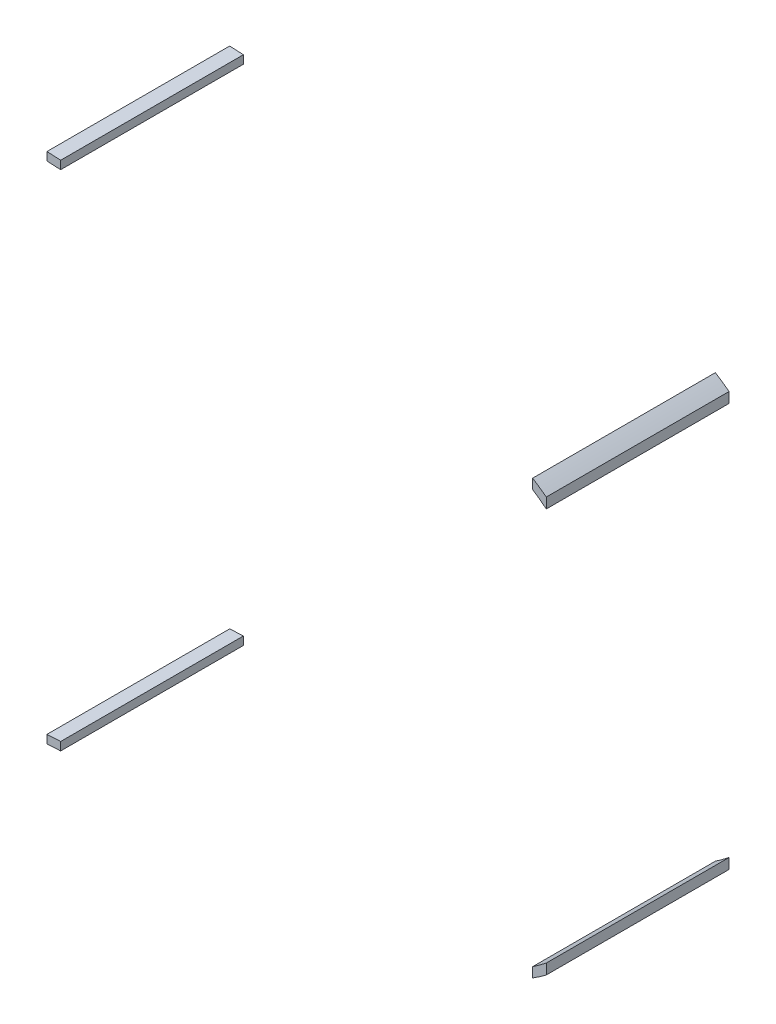
ISO-10303-21;
HEADER;
FILE_DESCRIPTION(('STEP AP214'),'2;1');
FILE_NAME('part.step','',(''),(''),'','','');
FILE_SCHEMA(('AUTOMOTIVE_DESIGN { 1 0 10303 214 1 1 1 1 }'));
ENDSEC;
DATA;
#1=APPLICATION_CONTEXT('core data for automotive mechanical design processes');
#2=APPLICATION_PROTOCOL_DEFINITION('international standard','automotive_design',2000,#1);
#3=PRODUCT_CONTEXT('',#1,'mechanical');
#4=PRODUCT('Part','Part','',(#3));
#5=PRODUCT_RELATED_PRODUCT_CATEGORY('part','',(#4));
#6=PRODUCT_DEFINITION_FORMATION('','',#4);
#7=PRODUCT_DEFINITION_CONTEXT('part definition',#1,'design');
#8=PRODUCT_DEFINITION('design','',#6,#7);
#9=PRODUCT_DEFINITION_SHAPE('','',#8);
#10=(LENGTH_UNIT() NAMED_UNIT(*) SI_UNIT(.MILLI.,.METRE.));
#11=(NAMED_UNIT(*) PLANE_ANGLE_UNIT() SI_UNIT($,.RADIAN.));
#12=(NAMED_UNIT(*) SI_UNIT($,.STERADIAN.) SOLID_ANGLE_UNIT());
#13=UNCERTAINTY_MEASURE_WITH_UNIT(LENGTH_MEASURE(1.E-05),#10,'distance_accuracy_value','');
#14=(GEOMETRIC_REPRESENTATION_CONTEXT(3) GLOBAL_UNCERTAINTY_ASSIGNED_CONTEXT((#13)) GLOBAL_UNIT_ASSIGNED_CONTEXT((#10,
#11,#12)) REPRESENTATION_CONTEXT('',''));
#15=CARTESIAN_POINT('',(0.,0.,0.));
#16=DIRECTION('',(0.,0.,1.));
#17=DIRECTION('',(1.,0.,0.));
#18=AXIS2_PLACEMENT_3D('',#15,#16,#17);
#19=CARTESIAN_POINT('',(19.8026066350711,49.7447573011769,40.));
#20=DIRECTION('',(-1.,0.,0.));
#21=DIRECTION('',(0.,0.,1.));
#22=AXIS2_PLACEMENT_3D('',#19,#20,#21);
#23=PLANE('',#22);
#24=DIRECTION('',(0.,1.,0.));
#25=VECTOR('',#24,1.);
#26=CARTESIAN_POINT('',(19.8026066350711,49.7447573011769,0.));
#27=LINE('',#26,#25);
#28=CARTESIAN_POINT('',(19.8026066350711,49.7447573011769,0.));
#29=VERTEX_POINT('',#28);
#30=CARTESIAN_POINT('',(19.8026066350711,51.5470550162142,0.));
#31=VERTEX_POINT('',#30);
#32=EDGE_CURVE('E113',#29,#31,#27,.T.);
#33=ORIENTED_EDGE('',*,*,#32,.T.);
#34=DIRECTION('',(0.,0.,-1.));
#35=VECTOR('',#34,1.);
#36=CARTESIAN_POINT('',(19.8026066350711,51.5470550162142,40.));
#37=LINE('',#36,#35);
#38=CARTESIAN_POINT('',(19.8026066350711,51.5470550162142,40.));
#39=VERTEX_POINT('',#38);
#40=EDGE_CURVE('E12',#39,#31,#37,.T.);
#41=ORIENTED_EDGE('',*,*,#40,.F.);
#42=DIRECTION('',(0.,1.,0.));
#43=VECTOR('',#42,1.);
#44=CARTESIAN_POINT('',(19.8026066350711,49.7447573011769,40.));
#45=LINE('',#44,#43);
#46=CARTESIAN_POINT('',(19.8026066350711,49.7447573011769,40.));
#47=VERTEX_POINT('',#46);
#48=EDGE_CURVE('E101',#47,#39,#45,.T.);
#49=ORIENTED_EDGE('',*,*,#48,.F.);
#50=DIRECTION('',(0.,0.,-1.));
#51=VECTOR('',#50,1.);
#52=CARTESIAN_POINT('',(19.8026066350711,49.7447573011769,40.));
#53=LINE('',#52,#51);
#54=EDGE_CURVE('E109',#47,#29,#53,.T.);
#55=ORIENTED_EDGE('',*,*,#54,.T.);
#56=EDGE_LOOP('',(#33,#41,#49,#55));
#57=FACE_BOUND('',#56,.T.);
#58=ADVANCED_FACE('F50',(#57),#23,.F.);
#59=CARTESIAN_POINT('',(16.8026066350711,51.6986855396437,40.));
#60=DIRECTION('',(-0.0504790708541755,-0.998725119042121,0.));
#61=DIRECTION('',(0.998725119042121,-0.0504790708541755,0.));
#62=AXIS2_PLACEMENT_3D('',#59,#60,#61);
#63=PLANE('',#62);
#64=DIRECTION('',(-0.998725119042121,0.0504790708541755,0.));
#65=VECTOR('',#64,1.);
#66=CARTESIAN_POINT('',(16.8026066350711,51.6986855396437,0.));
#67=LINE('',#66,#65);
#68=CARTESIAN_POINT('',(16.8026066350711,51.6986855396437,0.));
#69=VERTEX_POINT('',#68);
#70=EDGE_CURVE('E105',#31,#69,#67,.T.);
#71=ORIENTED_EDGE('',*,*,#70,.T.);
#72=DIRECTION('',(0.,0.,-1.));
#73=VECTOR('',#72,1.);
#74=CARTESIAN_POINT('',(16.8026066350711,51.6986855396437,40.));
#75=LINE('',#74,#73);
#76=CARTESIAN_POINT('',(16.8026066350711,51.6986855396437,40.));
#77=VERTEX_POINT('',#76);
#78=EDGE_CURVE('E58',#77,#69,#75,.T.);
#79=ORIENTED_EDGE('',*,*,#78,.F.);
#80=DIRECTION('',(-0.998725119042121,0.0504790708541755,0.));
#81=VECTOR('',#80,1.);
#82=CARTESIAN_POINT('',(16.8026066350711,51.6986855396437,40.));
#83=LINE('',#82,#81);
#84=EDGE_CURVE('E96',#39,#77,#83,.T.);
#85=ORIENTED_EDGE('',*,*,#84,.F.);
#86=ORIENTED_EDGE('',*,*,#40,.T.);
#87=EDGE_LOOP('',(#71,#79,#85,#86));
#88=FACE_BOUND('',#87,.T.);
#89=ADVANCED_FACE('F104',(#88),#63,.F.);
#90=CARTESIAN_POINT('',(16.8026066350711,49.8963878246064,40.));
#91=DIRECTION('',(1.,0.,0.));
#92=DIRECTION('',(0.,1.,0.));
#93=AXIS2_PLACEMENT_3D('',#90,#91,#92);
#94=PLANE('',#93);
#95=DIRECTION('',(0.,-1.,0.));
#96=VECTOR('',#95,1.);
#97=CARTESIAN_POINT('',(16.8026066350711,49.8963878246064,0.));
#98=LINE('',#97,#96);
#99=CARTESIAN_POINT('',(16.8026066350711,49.8963878246064,0.));
#100=VERTEX_POINT('',#99);
#101=EDGE_CURVE('E83',#69,#100,#98,.T.);
#102=ORIENTED_EDGE('',*,*,#101,.T.);
#103=DIRECTION('',(0.,0.,-1.));
#104=VECTOR('',#103,1.);
#105=CARTESIAN_POINT('',(16.8026066350711,49.8963878246064,40.));
#106=LINE('',#105,#104);
#107=CARTESIAN_POINT('',(16.8026066350711,49.8963878246064,40.));
#108=VERTEX_POINT('',#107);
#109=EDGE_CURVE('E106',#108,#100,#106,.T.);
#110=ORIENTED_EDGE('',*,*,#109,.F.);
#111=DIRECTION('',(0.,-1.,0.));
#112=VECTOR('',#111,1.);
#113=CARTESIAN_POINT('',(16.8026066350711,49.8963878246064,40.));
#114=LINE('',#113,#112);
#115=EDGE_CURVE('E99',#77,#108,#114,.T.);
#116=ORIENTED_EDGE('',*,*,#115,.F.);
#117=ORIENTED_EDGE('',*,*,#78,.T.);
#118=EDGE_LOOP('',(#102,#110,#116,#117));
#119=FACE_BOUND('',#118,.T.);
#120=ADVANCED_FACE('F107',(#119),#94,.F.);
#121=CARTESIAN_POINT('',(19.8026066350711,49.7447573011769,40.));
#122=DIRECTION('',(0.0504790708541733,0.998725119042121,0.));
#123=DIRECTION('',(-0.998725119042121,0.0504790708541733,0.));
#124=AXIS2_PLACEMENT_3D('',#121,#122,#123);
#125=PLANE('',#124);
#126=DIRECTION('',(0.998725119042121,-0.0504790708541733,0.));
#127=VECTOR('',#126,1.);
#128=CARTESIAN_POINT('',(19.8026066350711,49.7447573011769,0.));
#129=LINE('',#128,#127);
#130=EDGE_CURVE('E89',#100,#29,#129,.T.);
#131=ORIENTED_EDGE('',*,*,#130,.T.);
#132=ORIENTED_EDGE('',*,*,#54,.F.);
#133=DIRECTION('',(0.998725119042121,-0.0504790708541733,0.));
#134=VECTOR('',#133,1.);
#135=CARTESIAN_POINT('',(19.8026066350711,49.7447573011769,40.));
#136=LINE('',#135,#134);
#137=EDGE_CURVE('E66',#108,#47,#136,.T.);
#138=ORIENTED_EDGE('',*,*,#137,.F.);
#139=ORIENTED_EDGE('',*,*,#109,.T.);
#140=EDGE_LOOP('',(#131,#132,#138,#139));
#141=FACE_BOUND('',#140,.T.);
#142=ADVANCED_FACE('F120',(#141),#125,.F.);
#143=CARTESIAN_POINT('',(0.,0.,40.));
#144=DIRECTION('',(0.,0.,-1.));
#145=DIRECTION('',(-1.,0.,0.));
#146=AXIS2_PLACEMENT_3D('',#143,#144,#145);
#147=PLANE('',#146);
#148=ORIENTED_EDGE('',*,*,#48,.T.);
#149=ORIENTED_EDGE('',*,*,#84,.T.);
#150=ORIENTED_EDGE('',*,*,#115,.T.);
#151=ORIENTED_EDGE('',*,*,#137,.T.);
#152=EDGE_LOOP('',(#148,#149,#150,#151));
#153=FACE_BOUND('',#152,.T.);
#154=ADVANCED_FACE('F97',(#153),#147,.F.);
#155=CARTESIAN_POINT('',(0.,0.,0.));
#156=DIRECTION('',(0.,0.,-1.));
#157=DIRECTION('',(-1.,0.,0.));
#158=AXIS2_PLACEMENT_3D('',#155,#156,#157);
#159=PLANE('',#158);
#160=ORIENTED_EDGE('',*,*,#32,.F.);
#161=ORIENTED_EDGE('',*,*,#130,.F.);
#162=ORIENTED_EDGE('',*,*,#101,.F.);
#163=ORIENTED_EDGE('',*,*,#70,.F.);
#164=EDGE_LOOP('',(#160,#161,#162,#163));
#165=FACE_BOUND('',#164,.T.);
#166=ADVANCED_FACE('F123',(#165),#159,.T.);
#167=CLOSED_SHELL('',(#58,#89,#120,#142,#154,#166));
#168=MANIFOLD_SOLID_BREP('B2',#167);
#169=CARTESIAN_POINT('',(123.102606631487,40.7834426184924,40.));
#170=CARTESIAN_POINT('',(124.131030901251,40.09355676601,40.));
#171=CARTESIAN_POINT('',(125.126920542178,39.3562338158426,40.));
#172=CARTESIAN_POINT('',(126.10260663293,38.5894530904536,40.));
#173=B_SPLINE_CURVE_WITH_KNOTS('',3,(#169,#170,#171,#172),.UNSPECIFIED.,.F.,.F.,(4,4),(0.,
0.241038019452371),.UNSPECIFIED.);
#174=DIRECTION('',(0.,0.,-1.));
#175=VECTOR('',#174,1.);
#176=SURFACE_OF_LINEAR_EXTRUSION('',#173,#175);
#177=CARTESIAN_POINT('',(123.102606631487,40.7834426184924,0.));
#178=CARTESIAN_POINT('',(124.131030901251,40.09355676601,0.));
#179=CARTESIAN_POINT('',(125.126920542178,39.3562338158426,0.));
#180=CARTESIAN_POINT('',(126.10260663293,38.5894530904536,0.));
#181=B_SPLINE_CURVE_WITH_KNOTS('',3,(#177,#178,#179,#180),.UNSPECIFIED.,.F.,.F.,(4,4),(0.,
0.241038019452371),.UNSPECIFIED.);
#182=CARTESIAN_POINT('',(123.102606631487,40.7834426184924,0.));
#183=VERTEX_POINT('',#182);
#184=CARTESIAN_POINT('',(126.10260663293,38.5894530904536,0.));
#185=VERTEX_POINT('',#184);
#186=EDGE_CURVE('E342',#183,#185,#181,.T.);
#187=ORIENTED_EDGE('',*,*,#186,.T.);
#188=DIRECTION('',(0.,0.,-1.));
#189=VECTOR('',#188,1.);
#190=CARTESIAN_POINT('',(126.10260663293,38.5894530904536,40.));
#191=LINE('',#190,#189);
#192=CARTESIAN_POINT('',(126.10260663293,38.5894530904536,40.));
#193=VERTEX_POINT('',#192);
#194=EDGE_CURVE('E48',#193,#185,#191,.T.);
#195=ORIENTED_EDGE('',*,*,#194,.F.);
#196=CARTESIAN_POINT('',(126.10260663293,38.5894530904536,40.));
#197=CARTESIAN_POINT('',(125.126920542178,39.3562338158426,40.));
#198=CARTESIAN_POINT('',(124.131030901251,40.09355676601,40.));
#199=CARTESIAN_POINT('',(123.102606631487,40.7834426184924,40.));
#200=B_SPLINE_CURVE_WITH_KNOTS('',3,(#196,#197,#198,#199),.UNSPECIFIED.,.F.,.F.,(4,4),(0.,
0.241038019452371),.UNSPECIFIED.);
#201=CARTESIAN_POINT('',(123.102606631487,40.7834426184924,40.));
#202=VERTEX_POINT('',#201);
#203=EDGE_CURVE('E243',#202,#193,#200,.F.);
#204=ORIENTED_EDGE('',*,*,#203,.F.);
#205=DIRECTION('',(0.,0.,-1.));
#206=VECTOR('',#205,1.);
#207=CARTESIAN_POINT('',(123.102606631487,40.7834426184924,40.));
#208=LINE('',#207,#206);
#209=EDGE_CURVE('E328',#202,#183,#208,.T.);
#210=ORIENTED_EDGE('',*,*,#209,.T.);
#211=EDGE_LOOP('',(#187,#195,#204,#210));
#212=FACE_BOUND('',#211,.T.);
#213=ADVANCED_FACE('F184',(#212),#176,.F.);
#214=CARTESIAN_POINT('',(126.102606631489,40.8584151195204,40.));
#215=DIRECTION('',(-1.,-6.35367440709757E-10,0.));
#216=DIRECTION('',(6.35367440709757E-10,-1.,0.));
#217=AXIS2_PLACEMENT_3D('',#214,#215,#216);
#218=PLANE('',#217);
#219=DIRECTION('',(-6.35367440709757E-10,1.,0.));
#220=VECTOR('',#219,1.);
#221=CARTESIAN_POINT('',(126.102606631489,40.8584151195204,0.));
#222=LINE('',#221,#220);
#223=CARTESIAN_POINT('',(126.102606631489,40.8584151195204,0.));
#224=VERTEX_POINT('',#223);
#225=EDGE_CURVE('E248',#185,#224,#222,.T.);
#226=ORIENTED_EDGE('',*,*,#225,.T.);
#227=DIRECTION('',(0.,0.,-1.));
#228=VECTOR('',#227,1.);
#229=CARTESIAN_POINT('',(126.102606631489,40.8584151195204,40.));
#230=LINE('',#229,#228);
#231=CARTESIAN_POINT('',(126.102606631489,40.8584151195204,40.));
#232=VERTEX_POINT('',#231);
#233=EDGE_CURVE('E197',#232,#224,#230,.T.);
#234=ORIENTED_EDGE('',*,*,#233,.F.);
#235=DIRECTION('',(-6.35367440709757E-10,1.,0.));
#236=VECTOR('',#235,1.);
#237=CARTESIAN_POINT('',(126.102606631489,40.8584151195204,40.));
#238=LINE('',#237,#236);
#239=EDGE_CURVE('E237',#193,#232,#238,.T.);
#240=ORIENTED_EDGE('',*,*,#239,.F.);
#241=ORIENTED_EDGE('',*,*,#194,.T.);
#242=EDGE_LOOP('',(#226,#234,#240,#241));
#243=FACE_BOUND('',#242,.T.);
#244=ADVANCED_FACE('F247',(#243),#218,.F.);
#245=CARTESIAN_POINT('',(126.102606631489,40.8584151195204,40.));
#246=CARTESIAN_POINT('',(125.127954037551,41.5879931882622,40.));
#247=CARTESIAN_POINT('',(124.131312478951,42.2834784096465,40.));
#248=CARTESIAN_POINT('',(123.102606631487,42.9292494710995,40.));
#249=B_SPLINE_CURVE_WITH_KNOTS('',3,(#245,#246,#247,#248),.UNSPECIFIED.,.F.,.F.,(4,4),
(0.757538637454445,1.),.UNSPECIFIED.);
#250=DIRECTION('',(0.,0.,-1.));
#251=VECTOR('',#250,1.);
#252=SURFACE_OF_LINEAR_EXTRUSION('',#249,#251);
#253=CARTESIAN_POINT('',(126.102606631489,40.8584151195204,0.));
#254=CARTESIAN_POINT('',(125.127954037551,41.5879931882622,0.));
#255=CARTESIAN_POINT('',(124.131312478951,42.2834784096465,0.));
#256=CARTESIAN_POINT('',(123.102606631487,42.9292494710995,0.));
#257=B_SPLINE_CURVE_WITH_KNOTS('',3,(#253,#254,#255,#256),.UNSPECIFIED.,.F.,.F.,(4,4),
(0.757538637454445,1.),.UNSPECIFIED.);
#258=CARTESIAN_POINT('',(123.102606631488,42.9292494710995,0.));
#259=VERTEX_POINT('',#258);
#260=EDGE_CURVE('E223',#224,#259,#257,.T.);
#261=ORIENTED_EDGE('',*,*,#260,.T.);
#262=DIRECTION('',(0.,0.,-1.));
#263=VECTOR('',#262,1.);
#264=CARTESIAN_POINT('',(123.102606631488,42.9292494710995,40.));
#265=LINE('',#264,#263);
#266=CARTESIAN_POINT('',(123.102606631488,42.9292494710995,40.));
#267=VERTEX_POINT('',#266);
#268=EDGE_CURVE('E249',#267,#259,#265,.T.);
#269=ORIENTED_EDGE('',*,*,#268,.F.);
#270=CARTESIAN_POINT('',(123.102606631487,42.9292494710995,40.));
#271=CARTESIAN_POINT('',(124.131312478951,42.2834784096465,40.));
#272=CARTESIAN_POINT('',(125.127954037551,41.5879931882622,40.));
#273=CARTESIAN_POINT('',(126.102606631489,40.8584151195204,40.));
#274=B_SPLINE_CURVE_WITH_KNOTS('',3,(#270,#271,#272,#273),.UNSPECIFIED.,.F.,.F.,(4,4),
(0.757538637454445,1.),.UNSPECIFIED.);
#275=EDGE_CURVE('E240',#232,#267,#274,.F.);
#276=ORIENTED_EDGE('',*,*,#275,.F.);
#277=ORIENTED_EDGE('',*,*,#233,.T.);
#278=EDGE_LOOP('',(#261,#269,#276,#277));
#279=FACE_BOUND('',#278,.T.);
#280=ADVANCED_FACE('F252',(#279),#252,.F.);
#281=CARTESIAN_POINT('',(123.102606631487,40.7834426184924,40.));
#282=DIRECTION('',(1.,0.,0.));
#283=DIRECTION('',(0.,1.,0.));
#284=AXIS2_PLACEMENT_3D('',#281,#282,#283);
#285=PLANE('',#284);
#286=DIRECTION('',(0.,-1.,0.));
#287=VECTOR('',#286,1.);
#288=CARTESIAN_POINT('',(123.102606631487,40.7834426184924,0.));
#289=LINE('',#288,#287);
#290=EDGE_CURVE('E230',#259,#183,#289,.T.);
#291=ORIENTED_EDGE('',*,*,#290,.T.);
#292=ORIENTED_EDGE('',*,*,#209,.F.);
#293=DIRECTION('',(0.,-1.,0.));
#294=VECTOR('',#293,1.);
#295=CARTESIAN_POINT('',(123.102606631487,40.7834426184924,40.));
#296=LINE('',#295,#294);
#297=EDGE_CURVE('E206',#267,#202,#296,.T.);
#298=ORIENTED_EDGE('',*,*,#297,.F.);
#299=ORIENTED_EDGE('',*,*,#268,.T.);
#300=EDGE_LOOP('',(#291,#292,#298,#299));
#301=FACE_BOUND('',#300,.T.);
#302=ADVANCED_FACE('F271',(#301),#285,.F.);
#303=CARTESIAN_POINT('',(124.622383449338,39.715283431813,40.));
#304=DIRECTION('',(0.,0.,-1.));
#305=DIRECTION('',(-1.,0.,0.));
#306=AXIS2_PLACEMENT_3D('',#303,#304,#305);
#307=PLANE('',#306);
#308=ORIENTED_EDGE('',*,*,#203,.T.);
#309=ORIENTED_EDGE('',*,*,#239,.T.);
#310=ORIENTED_EDGE('',*,*,#275,.T.);
#311=ORIENTED_EDGE('',*,*,#297,.T.);
#312=EDGE_LOOP('',(#308,#309,#310,#311));
#313=FACE_BOUND('',#312,.T.);
#314=ADVANCED_FACE('F238',(#313),#307,.F.);
#315=CARTESIAN_POINT('',(124.622383449338,39.715283431813,0.));
#316=DIRECTION('',(0.,0.,-1.));
#317=DIRECTION('',(-1.,0.,0.));
#318=AXIS2_PLACEMENT_3D('',#315,#316,#317);
#319=PLANE('',#318);
#320=ORIENTED_EDGE('',*,*,#186,.F.);
#321=ORIENTED_EDGE('',*,*,#290,.F.);
#322=ORIENTED_EDGE('',*,*,#260,.F.);
#323=ORIENTED_EDGE('',*,*,#225,.F.);
#324=EDGE_LOOP('',(#320,#321,#322,#323));
#325=FACE_BOUND('',#324,.T.);
#326=ADVANCED_FACE('F301',(#325),#319,.T.);
#327=CLOSED_SHELL('',(#213,#244,#280,#302,#314,#326));
#328=MANIFOLD_SOLID_BREP('B6',#327);
#329=CARTESIAN_POINT('',(126.102606631487,-47.475709012651,40.));
#330=CARTESIAN_POINT('',(125.126920541239,-48.2424897386817,40.));
#331=CARTESIAN_POINT('',(124.131030900797,-48.9798126895041,40.));
#332=CARTESIAN_POINT('',(123.102606631487,-49.669698542663,40.));
#333=B_SPLINE_CURVE_WITH_KNOTS('',3,(#329,#330,#331,#332),.UNSPECIFIED.,.F.,.F.,(4,4),(0.,
0.241038019452371),.UNSPECIFIED.);
#334=DIRECTION('',(0.,0.,-1.));
#335=VECTOR('',#334,1.);
#336=SURFACE_OF_LINEAR_EXTRUSION('',#333,#335);
#337=CARTESIAN_POINT('',(126.102606631487,-47.475709012651,0.));
#338=CARTESIAN_POINT('',(125.126920541239,-48.2424897386817,0.));
#339=CARTESIAN_POINT('',(124.131030900797,-48.9798126895041,0.));
#340=CARTESIAN_POINT('',(123.102606631487,-49.669698542663,0.));
#341=B_SPLINE_CURVE_WITH_KNOTS('',3,(#337,#338,#339,#340),.UNSPECIFIED.,.F.,.F.,(4,4),(0.,
0.241038019452371),.UNSPECIFIED.);
#342=CARTESIAN_POINT('',(126.102606631487,-47.475709012651,0.));
#343=VERTEX_POINT('',#342);
#344=CARTESIAN_POINT('',(123.102606631487,-49.669698542663,0.));
#345=VERTEX_POINT('',#344);
#346=EDGE_CURVE('E586',#343,#345,#341,.T.);
#347=ORIENTED_EDGE('',*,*,#346,.T.);
#348=DIRECTION('',(0.,0.,-1.));
#349=VECTOR('',#348,1.);
#350=CARTESIAN_POINT('',(123.102606631487,-49.669698542663,40.));
#351=LINE('',#350,#349);
#352=CARTESIAN_POINT('',(123.102606631487,-49.669698542663,40.));
#353=VERTEX_POINT('',#352);
#354=EDGE_CURVE('E182',#353,#345,#351,.T.);
#355=ORIENTED_EDGE('',*,*,#354,.F.);
#356=CARTESIAN_POINT('',(123.102606631487,-49.669698542663,40.));
#357=CARTESIAN_POINT('',(124.131030900797,-48.9798126895041,40.));
#358=CARTESIAN_POINT('',(125.126920541239,-48.2424897386817,40.));
#359=CARTESIAN_POINT('',(126.102606631487,-47.475709012651,40.));
#360=B_SPLINE_CURVE_WITH_KNOTS('',3,(#356,#357,#358,#359),.UNSPECIFIED.,.F.,.F.,(4,4),(0.,
0.241038019452371),.UNSPECIFIED.);
#361=CARTESIAN_POINT('',(126.102606631487,-47.475709012651,40.));
#362=VERTEX_POINT('',#361);
#363=EDGE_CURVE('E483',#362,#353,#360,.F.);
#364=ORIENTED_EDGE('',*,*,#363,.F.);
#365=DIRECTION('',(0.,0.,-1.));
#366=VECTOR('',#365,1.);
#367=CARTESIAN_POINT('',(126.102606631487,-47.475709012651,40.));
#368=LINE('',#367,#366);
#369=EDGE_CURVE('E571',#362,#343,#368,.T.);
#370=ORIENTED_EDGE('',*,*,#369,.T.);
#371=EDGE_LOOP('',(#347,#355,#364,#370));
#372=FACE_BOUND('',#371,.T.);
#373=ADVANCED_FACE('F423',(#372),#336,.F.);
#374=CARTESIAN_POINT('',(123.102606631487,-49.669698542663,40.));
#375=DIRECTION('',(1.,0.,0.));
#376=DIRECTION('',(0.,1.,0.));
#377=AXIS2_PLACEMENT_3D('',#374,#375,#376);
#378=PLANE('',#377);
#379=DIRECTION('',(0.,-1.,0.));
#380=VECTOR('',#379,1.);
#381=CARTESIAN_POINT('',(123.102606631487,-49.669698542663,0.));
#382=LINE('',#381,#380);
#383=CARTESIAN_POINT('',(123.102606631487,-51.8155053952701,0.));
#384=VERTEX_POINT('',#383);
#385=EDGE_CURVE('E489',#345,#384,#382,.T.);
#386=ORIENTED_EDGE('',*,*,#385,.T.);
#387=DIRECTION('',(0.,0.,-1.));
#388=VECTOR('',#387,1.);
#389=CARTESIAN_POINT('',(123.102606631487,-51.8155053952701,40.));
#390=LINE('',#389,#388);
#391=CARTESIAN_POINT('',(123.102606631487,-51.8155053952701,40.));
#392=VERTEX_POINT('',#391);
#393=EDGE_CURVE('E437',#392,#384,#390,.T.);
#394=ORIENTED_EDGE('',*,*,#393,.F.);
#395=DIRECTION('',(0.,-1.,0.));
#396=VECTOR('',#395,1.);
#397=CARTESIAN_POINT('',(123.102606631487,-49.669698542663,40.));
#398=LINE('',#397,#396);
#399=EDGE_CURVE('E477',#353,#392,#398,.T.);
#400=ORIENTED_EDGE('',*,*,#399,.F.);
#401=ORIENTED_EDGE('',*,*,#354,.T.);
#402=EDGE_LOOP('',(#386,#394,#400,#401));
#403=FACE_BOUND('',#402,.T.);
#404=ADVANCED_FACE('F488',(#403),#378,.F.);
#405=CARTESIAN_POINT('',(123.102606631487,-51.8155053952701,40.));
#406=CARTESIAN_POINT('',(124.131312478951,-51.1697343338164,40.));
#407=CARTESIAN_POINT('',(125.12795403755,-50.4742491124314,40.));
#408=CARTESIAN_POINT('',(126.102606631487,-49.7446710436889,40.));
#409=B_SPLINE_CURVE_WITH_KNOTS('',3,(#405,#406,#407,#408),.UNSPECIFIED.,.F.,.F.,(4,4),
(0.757538637454445,1.),.UNSPECIFIED.);
#410=DIRECTION('',(0.,0.,-1.));
#411=VECTOR('',#410,1.);
#412=SURFACE_OF_LINEAR_EXTRUSION('',#409,#411);
#413=CARTESIAN_POINT('',(123.102606631487,-51.8155053952701,0.));
#414=CARTESIAN_POINT('',(124.131312478951,-51.1697343338164,0.));
#415=CARTESIAN_POINT('',(125.12795403755,-50.4742491124314,0.));
#416=CARTESIAN_POINT('',(126.102606631487,-49.7446710436889,0.));
#417=B_SPLINE_CURVE_WITH_KNOTS('',3,(#413,#414,#415,#416),.UNSPECIFIED.,.F.,.F.,(4,4),
(0.757538637454445,1.),.UNSPECIFIED.);
#418=CARTESIAN_POINT('',(126.102606631487,-49.7446710436889,0.));
#419=VERTEX_POINT('',#418);
#420=EDGE_CURVE('E463',#384,#419,#417,.T.);
#421=ORIENTED_EDGE('',*,*,#420,.T.);
#422=DIRECTION('',(0.,0.,-1.));
#423=VECTOR('',#422,1.);
#424=CARTESIAN_POINT('',(126.102606631487,-49.7446710436889,40.));
#425=LINE('',#424,#423);
#426=CARTESIAN_POINT('',(126.102606631487,-49.7446710436889,40.));
#427=VERTEX_POINT('',#426);
#428=EDGE_CURVE('E491',#427,#419,#425,.T.);
#429=ORIENTED_EDGE('',*,*,#428,.F.);
#430=CARTESIAN_POINT('',(126.102606631487,-49.7446710436889,40.));
#431=CARTESIAN_POINT('',(125.12795403755,-50.4742491124314,40.));
#432=CARTESIAN_POINT('',(124.131312478951,-51.1697343338164,40.));
#433=CARTESIAN_POINT('',(123.102606631487,-51.8155053952701,40.));
#434=B_SPLINE_CURVE_WITH_KNOTS('',3,(#430,#431,#432,#433),.UNSPECIFIED.,.F.,.F.,(4,4),
(0.757538637454445,1.),.UNSPECIFIED.);
#435=EDGE_CURVE('E480',#392,#427,#434,.F.);
#436=ORIENTED_EDGE('',*,*,#435,.F.);
#437=ORIENTED_EDGE('',*,*,#393,.T.);
#438=EDGE_LOOP('',(#421,#429,#436,#437));
#439=FACE_BOUND('',#438,.T.);
#440=ADVANCED_FACE('F494',(#439),#412,.F.);
#441=CARTESIAN_POINT('',(126.102606631487,-49.7446710436889,40.));
#442=DIRECTION('',(-1.,0.,0.));
#443=DIRECTION('',(0.,0.,1.));
#444=AXIS2_PLACEMENT_3D('',#441,#442,#443);
#445=PLANE('',#444);
#446=DIRECTION('',(0.,1.,0.));
#447=VECTOR('',#446,1.);
#448=CARTESIAN_POINT('',(126.102606631487,-49.7446710436889,0.));
#449=LINE('',#448,#447);
#450=EDGE_CURVE('E470',#419,#343,#449,.T.);
#451=ORIENTED_EDGE('',*,*,#450,.T.);
#452=ORIENTED_EDGE('',*,*,#369,.F.);
#453=DIRECTION('',(0.,1.,0.));
#454=VECTOR('',#453,1.);
#455=CARTESIAN_POINT('',(126.102606631487,-49.7446710436889,40.));
#456=LINE('',#455,#454);
#457=EDGE_CURVE('E446',#427,#362,#456,.T.);
#458=ORIENTED_EDGE('',*,*,#457,.F.);
#459=ORIENTED_EDGE('',*,*,#428,.T.);
#460=EDGE_LOOP('',(#451,#452,#458,#459));
#461=FACE_BOUND('',#460,.T.);
#462=ADVANCED_FACE('F514',(#461),#445,.F.);
#463=CARTESIAN_POINT('',(124.622383448636,-48.6015393549839,40.));
#464=DIRECTION('',(0.,0.,1.));
#465=DIRECTION('',(1.,0.,0.));
#466=AXIS2_PLACEMENT_3D('',#463,#464,#465);
#467=PLANE('',#466);
#468=ORIENTED_EDGE('',*,*,#363,.T.);
#469=ORIENTED_EDGE('',*,*,#399,.T.);
#470=ORIENTED_EDGE('',*,*,#435,.T.);
#471=ORIENTED_EDGE('',*,*,#457,.T.);
#472=EDGE_LOOP('',(#468,#469,#470,#471));
#473=FACE_BOUND('',#472,.T.);
#474=ADVANCED_FACE('F478',(#473),#467,.T.);
#475=CARTESIAN_POINT('',(124.622383448636,-48.6015393549839,0.));
#476=DIRECTION('',(0.,0.,1.));
#477=DIRECTION('',(1.,0.,0.));
#478=AXIS2_PLACEMENT_3D('',#475,#476,#477);
#479=PLANE('',#478);
#480=ORIENTED_EDGE('',*,*,#346,.F.);
#481=ORIENTED_EDGE('',*,*,#450,.F.);
#482=ORIENTED_EDGE('',*,*,#420,.F.);
#483=ORIENTED_EDGE('',*,*,#385,.F.);
#484=EDGE_LOOP('',(#480,#481,#482,#483));
#485=FACE_BOUND('',#484,.T.);
#486=ADVANCED_FACE('F544',(#485),#479,.F.);
#487=CLOSED_SHELL('',(#373,#404,#440,#462,#474,#486));
#488=MANIFOLD_SOLID_BREP('B42',#487);
#489=CARTESIAN_POINT('',(19.8026066350711,-58.6310132253474,40.));
#490=DIRECTION('',(0.0504790708541733,-0.998725119042121,0.));
#491=DIRECTION('',(0.998725119042121,0.0504790708541733,0.));
#492=AXIS2_PLACEMENT_3D('',#489,#490,#491);
#493=PLANE('',#492);
#494=DIRECTION('',(-0.998725119042121,-0.0504790708541733,0.));
#495=VECTOR('',#494,1.);
#496=CARTESIAN_POINT('',(19.8026066350711,-58.6310132253474,0.));
#497=LINE('',#496,#495);
#498=CARTESIAN_POINT('',(19.8026066350711,-58.6310132253474,0.));
#499=VERTEX_POINT('',#498);
#500=CARTESIAN_POINT('',(16.8026066350711,-58.7826437487768,0.));
#501=VERTEX_POINT('',#500);
#502=EDGE_CURVE('E728',#499,#501,#497,.T.);
#503=ORIENTED_EDGE('',*,*,#502,.T.);
#504=DIRECTION('',(0.,0.,-1.));
#505=VECTOR('',#504,1.);
#506=CARTESIAN_POINT('',(16.8026066350711,-58.7826437487768,40.));
#507=LINE('',#506,#505);
#508=CARTESIAN_POINT('',(16.8026066350711,-58.7826437487768,40.));
#509=VERTEX_POINT('',#508);
#510=EDGE_CURVE('E421',#509,#501,#507,.T.);
#511=ORIENTED_EDGE('',*,*,#510,.F.);
#512=DIRECTION('',(-0.998725119042121,-0.0504790708541733,0.));
#513=VECTOR('',#512,1.);
#514=CARTESIAN_POINT('',(19.8026066350711,-58.6310132253474,40.));
#515=LINE('',#514,#513);
#516=CARTESIAN_POINT('',(19.8026066350711,-58.6310132253474,40.));
#517=VERTEX_POINT('',#516);
#518=EDGE_CURVE('E716',#517,#509,#515,.T.);
#519=ORIENTED_EDGE('',*,*,#518,.F.);
#520=DIRECTION('',(0.,0.,-1.));
#521=VECTOR('',#520,1.);
#522=CARTESIAN_POINT('',(19.8026066350711,-58.6310132253474,40.));
#523=LINE('',#522,#521);
#524=EDGE_CURVE('E724',#517,#499,#523,.T.);
#525=ORIENTED_EDGE('',*,*,#524,.T.);
#526=EDGE_LOOP('',(#503,#511,#519,#525));
#527=FACE_BOUND('',#526,.T.);
#528=ADVANCED_FACE('F665',(#527),#493,.F.);
#529=CARTESIAN_POINT('',(16.8026066350711,-58.7826437487768,40.));
#530=DIRECTION('',(1.,0.,0.));
#531=DIRECTION('',(0.,1.,0.));
#532=AXIS2_PLACEMENT_3D('',#529,#530,#531);
#533=PLANE('',#532);
#534=DIRECTION('',(0.,-1.,0.));
#535=VECTOR('',#534,1.);
#536=CARTESIAN_POINT('',(16.8026066350711,-58.7826437487768,0.));
#537=LINE('',#536,#535);
#538=CARTESIAN_POINT('',(16.8026066350711,-60.5849414638142,0.));
#539=VERTEX_POINT('',#538);
#540=EDGE_CURVE('E720',#501,#539,#537,.T.);
#541=ORIENTED_EDGE('',*,*,#540,.T.);
#542=DIRECTION('',(0.,0.,-1.));
#543=VECTOR('',#542,1.);
#544=CARTESIAN_POINT('',(16.8026066350711,-60.5849414638142,40.));
#545=LINE('',#544,#543);
#546=CARTESIAN_POINT('',(16.8026066350711,-60.5849414638142,40.));
#547=VERTEX_POINT('',#546);
#548=EDGE_CURVE('E673',#547,#539,#545,.T.);
#549=ORIENTED_EDGE('',*,*,#548,.F.);
#550=DIRECTION('',(0.,-1.,0.));
#551=VECTOR('',#550,1.);
#552=CARTESIAN_POINT('',(16.8026066350711,-58.7826437487768,40.));
#553=LINE('',#552,#551);
#554=EDGE_CURVE('E711',#509,#547,#553,.T.);
#555=ORIENTED_EDGE('',*,*,#554,.F.);
#556=ORIENTED_EDGE('',*,*,#510,.T.);
#557=EDGE_LOOP('',(#541,#549,#555,#556));
#558=FACE_BOUND('',#557,.T.);
#559=ADVANCED_FACE('F719',(#558),#533,.F.);
#560=CARTESIAN_POINT('',(16.8026066350711,-60.5849414638142,40.));
#561=DIRECTION('',(-0.0504790708541755,0.998725119042121,0.));
#562=DIRECTION('',(-0.998725119042121,-0.0504790708541755,0.));
#563=AXIS2_PLACEMENT_3D('',#560,#561,#562);
#564=PLANE('',#563);
#565=DIRECTION('',(0.998725119042121,0.0504790708541755,0.));
#566=VECTOR('',#565,1.);
#567=CARTESIAN_POINT('',(16.8026066350711,-60.5849414638142,0.));
#568=LINE('',#567,#566);
#569=CARTESIAN_POINT('',(19.8026066350711,-60.4333109403847,0.));
#570=VERTEX_POINT('',#569);
#571=EDGE_CURVE('E698',#539,#570,#568,.T.);
#572=ORIENTED_EDGE('',*,*,#571,.T.);
#573=DIRECTION('',(0.,0.,-1.));
#574=VECTOR('',#573,1.);
#575=CARTESIAN_POINT('',(19.8026066350711,-60.4333109403847,40.));
#576=LINE('',#575,#574);
#577=CARTESIAN_POINT('',(19.8026066350711,-60.4333109403847,40.));
#578=VERTEX_POINT('',#577);
#579=EDGE_CURVE('E721',#578,#570,#576,.T.);
#580=ORIENTED_EDGE('',*,*,#579,.F.);
#581=DIRECTION('',(0.998725119042121,0.0504790708541755,0.));
#582=VECTOR('',#581,1.);
#583=CARTESIAN_POINT('',(16.8026066350711,-60.5849414638142,40.));
#584=LINE('',#583,#582);
#585=EDGE_CURVE('E714',#547,#578,#584,.T.);
#586=ORIENTED_EDGE('',*,*,#585,.F.);
#587=ORIENTED_EDGE('',*,*,#548,.T.);
#588=EDGE_LOOP('',(#572,#580,#586,#587));
#589=FACE_BOUND('',#588,.T.);
#590=ADVANCED_FACE('F722',(#589),#564,.F.);
#591=CARTESIAN_POINT('',(19.8026066350711,-58.6310132253474,40.));
#592=DIRECTION('',(-1.,0.,0.));
#593=DIRECTION('',(0.,0.,1.));
#594=AXIS2_PLACEMENT_3D('',#591,#592,#593);
#595=PLANE('',#594);
#596=DIRECTION('',(0.,1.,0.));
#597=VECTOR('',#596,1.);
#598=CARTESIAN_POINT('',(19.8026066350711,-58.6310132253474,0.));
#599=LINE('',#598,#597);
#600=EDGE_CURVE('E704',#570,#499,#599,.T.);
#601=ORIENTED_EDGE('',*,*,#600,.T.);
#602=ORIENTED_EDGE('',*,*,#524,.F.);
#603=DIRECTION('',(0.,1.,0.));
#604=VECTOR('',#603,1.);
#605=CARTESIAN_POINT('',(19.8026066350711,-58.6310132253474,40.));
#606=LINE('',#605,#604);
#607=EDGE_CURVE('E681',#578,#517,#606,.T.);
#608=ORIENTED_EDGE('',*,*,#607,.F.);
#609=ORIENTED_EDGE('',*,*,#579,.T.);
#610=EDGE_LOOP('',(#601,#602,#608,#609));
#611=FACE_BOUND('',#610,.T.);
#612=ADVANCED_FACE('F735',(#611),#595,.F.);
#613=CARTESIAN_POINT('',(0.,0.,40.));
#614=DIRECTION('',(0.,0.,1.));
#615=DIRECTION('',(1.,0.,0.));
#616=AXIS2_PLACEMENT_3D('',#613,#614,#615);
#617=PLANE('',#616);
#618=ORIENTED_EDGE('',*,*,#518,.T.);
#619=ORIENTED_EDGE('',*,*,#554,.T.);
#620=ORIENTED_EDGE('',*,*,#585,.T.);
#621=ORIENTED_EDGE('',*,*,#607,.T.);
#622=EDGE_LOOP('',(#618,#619,#620,#621));
#623=FACE_BOUND('',#622,.T.);
#624=ADVANCED_FACE('F712',(#623),#617,.T.);
#625=CARTESIAN_POINT('',(0.,0.,0.));
#626=DIRECTION('',(0.,0.,1.));
#627=DIRECTION('',(1.,0.,0.));
#628=AXIS2_PLACEMENT_3D('',#625,#626,#627);
#629=PLANE('',#628);
#630=ORIENTED_EDGE('',*,*,#502,.F.);
#631=ORIENTED_EDGE('',*,*,#600,.F.);
#632=ORIENTED_EDGE('',*,*,#571,.F.);
#633=ORIENTED_EDGE('',*,*,#540,.F.);
#634=EDGE_LOOP('',(#630,#631,#632,#633));
#635=FACE_BOUND('',#634,.T.);
#636=ADVANCED_FACE('F738',(#635),#629,.F.);
#637=CLOSED_SHELL('',(#528,#559,#590,#612,#624,#636));
#638=MANIFOLD_SOLID_BREP('B176',#637);
#639=ADVANCED_BREP_SHAPE_REPRESENTATION('',(#18,#168,#328,#488,#638),#14);
#640=SHAPE_DEFINITION_REPRESENTATION(#9,#639);
ENDSEC;
END-ISO-10303-21;
